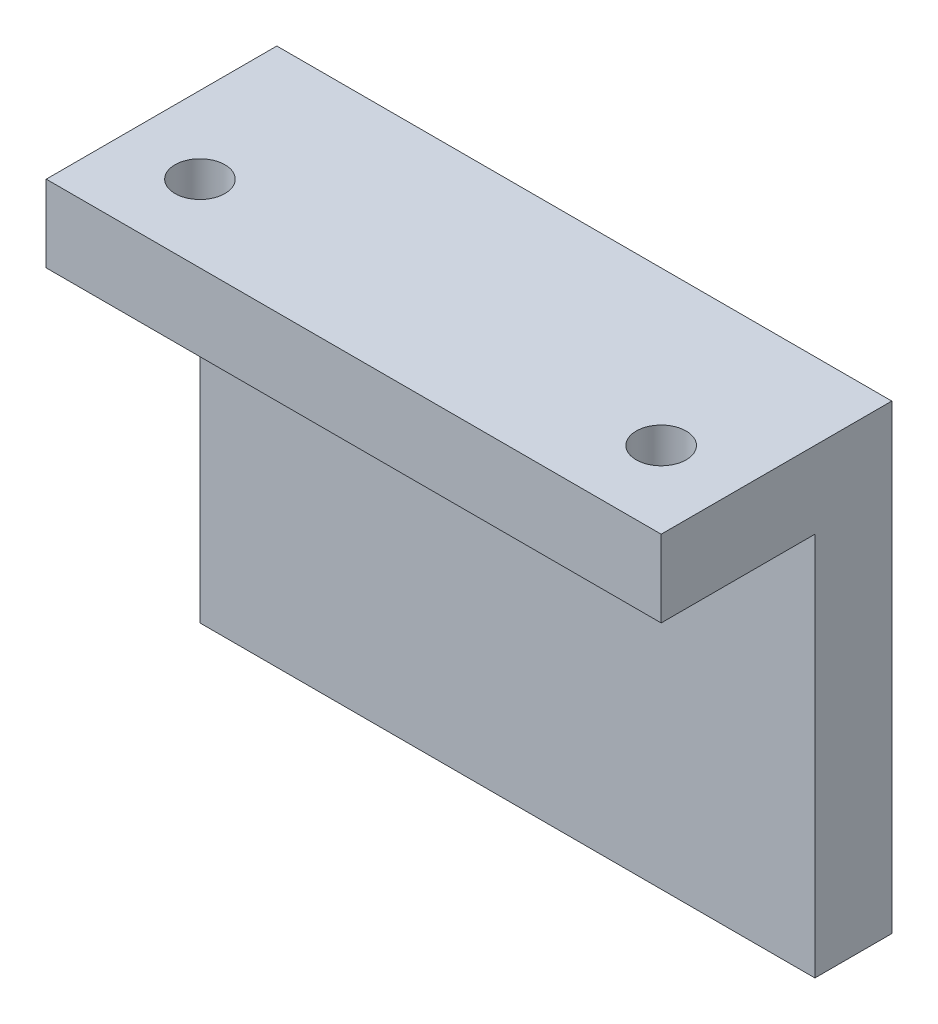
ISO-10303-21;
HEADER;
FILE_DESCRIPTION(('STEP AP214'),'2;1');
FILE_NAME('part.step','',(''),(''),'','','');
FILE_SCHEMA(('AUTOMOTIVE_DESIGN { 1 0 10303 214 1 1 1 1 }'));
ENDSEC;
DATA;
#1=APPLICATION_CONTEXT('core data for automotive mechanical design processes');
#2=APPLICATION_PROTOCOL_DEFINITION('international standard','automotive_design',2000,#1);
#3=PRODUCT_CONTEXT('',#1,'mechanical');
#4=PRODUCT('Part','Part','',(#3));
#5=PRODUCT_RELATED_PRODUCT_CATEGORY('part','',(#4));
#6=PRODUCT_DEFINITION_FORMATION('','',#4);
#7=PRODUCT_DEFINITION_CONTEXT('part definition',#1,'design');
#8=PRODUCT_DEFINITION('design','',#6,#7);
#9=PRODUCT_DEFINITION_SHAPE('','',#8);
#10=(LENGTH_UNIT() NAMED_UNIT(*) SI_UNIT(.MILLI.,.METRE.));
#11=(NAMED_UNIT(*) PLANE_ANGLE_UNIT() SI_UNIT($,.RADIAN.));
#12=(NAMED_UNIT(*) SI_UNIT($,.STERADIAN.) SOLID_ANGLE_UNIT());
#13=UNCERTAINTY_MEASURE_WITH_UNIT(LENGTH_MEASURE(1.E-05),#10,'distance_accuracy_value','');
#14=(GEOMETRIC_REPRESENTATION_CONTEXT(3) GLOBAL_UNCERTAINTY_ASSIGNED_CONTEXT((#13)) GLOBAL_UNIT_ASSIGNED_CONTEXT((#10,
#11,#12)) REPRESENTATION_CONTEXT('',''));
#15=CARTESIAN_POINT('',(0.,0.,0.));
#16=DIRECTION('',(0.,0.,1.));
#17=DIRECTION('',(1.,0.,0.));
#18=AXIS2_PLACEMENT_3D('',#15,#16,#17);
#19=CARTESIAN_POINT('',(0.,0.,5.));
#20=DIRECTION('',(1.,0.,0.));
#21=DIRECTION('',(0.,1.,0.));
#22=AXIS2_PLACEMENT_3D('',#19,#20,#21);
#23=PLANE('',#22);
#24=DIRECTION('',(0.,-1.,0.));
#25=VECTOR('',#24,1.);
#26=CARTESIAN_POINT('',(0.,0.,0.));
#27=LINE('',#26,#25);
#28=CARTESIAN_POINT('',(0.,0.,0.));
#29=VERTEX_POINT('',#28);
#30=CARTESIAN_POINT('',(0.,-30.,0.));
#31=VERTEX_POINT('',#30);
#32=EDGE_CURVE('E92',#29,#31,#27,.T.);
#33=ORIENTED_EDGE('',*,*,#32,.T.);
#34=DIRECTION('',(0.,0.,-1.));
#35=VECTOR('',#34,1.);
#36=CARTESIAN_POINT('',(0.,-30.,5.));
#37=LINE('',#36,#35);
#38=CARTESIAN_POINT('',(0.,-30.,5.));
#39=VERTEX_POINT('',#38);
#40=EDGE_CURVE('E11',#39,#31,#37,.T.);
#41=ORIENTED_EDGE('',*,*,#40,.F.);
#42=DIRECTION('',(0.,-1.,0.));
#43=VECTOR('',#42,1.);
#44=CARTESIAN_POINT('',(0.,0.,5.));
#45=LINE('',#44,#43);
#46=CARTESIAN_POINT('',(0.,-5.,5.));
#47=VERTEX_POINT('',#46);
#48=EDGE_CURVE('E85',#47,#39,#45,.T.);
#49=ORIENTED_EDGE('',*,*,#48,.F.);
#50=DIRECTION('',(0.,0.,-1.));
#51=VECTOR('',#50,1.);
#52=CARTESIAN_POINT('',(0.,-5.00000000000001,15.));
#53=LINE('',#52,#51);
#54=CARTESIAN_POINT('',(0.,-5.00000000000001,15.));
#55=VERTEX_POINT('',#54);
#56=EDGE_CURVE('E100',#55,#47,#53,.T.);
#57=ORIENTED_EDGE('',*,*,#56,.F.);
#58=DIRECTION('',(0.,-1.,0.));
#59=VECTOR('',#58,1.);
#60=CARTESIAN_POINT('',(0.,0.,15.));
#61=LINE('',#60,#59);
#62=CARTESIAN_POINT('',(0.,0.,15.));
#63=VERTEX_POINT('',#62);
#64=EDGE_CURVE('E95',#63,#55,#61,.T.);
#65=ORIENTED_EDGE('',*,*,#64,.F.);
#66=DIRECTION('',(0.,0.,-1.));
#67=VECTOR('',#66,1.);
#68=CARTESIAN_POINT('',(0.,0.,5.));
#69=LINE('',#68,#67);
#70=EDGE_CURVE('E78',#63,#29,#69,.T.);
#71=ORIENTED_EDGE('',*,*,#70,.T.);
#72=EDGE_LOOP('',(#33,#41,#49,#57,#65,#71));
#73=FACE_BOUND('',#72,.T.);
#74=ADVANCED_FACE('F33',(#73),#23,.F.);
#75=CARTESIAN_POINT('',(0.,-30.,5.));
#76=DIRECTION('',(0.,1.,0.));
#77=DIRECTION('',(0.,0.,1.));
#78=AXIS2_PLACEMENT_3D('',#75,#76,#77);
#79=PLANE('',#78);
#80=DIRECTION('',(1.,0.,0.));
#81=VECTOR('',#80,1.);
#82=CARTESIAN_POINT('',(0.,-30.,0.));
#83=LINE('',#82,#81);
#84=CARTESIAN_POINT('',(40.,-30.,0.));
#85=VERTEX_POINT('',#84);
#86=EDGE_CURVE('E99',#31,#85,#83,.T.);
#87=ORIENTED_EDGE('',*,*,#86,.T.);
#88=DIRECTION('',(0.,0.,-1.));
#89=VECTOR('',#88,1.);
#90=CARTESIAN_POINT('',(40.,-30.,5.));
#91=LINE('',#90,#89);
#92=CARTESIAN_POINT('',(40.,-30.,5.));
#93=VERTEX_POINT('',#92);
#94=EDGE_CURVE('E40',#93,#85,#91,.T.);
#95=ORIENTED_EDGE('',*,*,#94,.F.);
#96=DIRECTION('',(1.,0.,0.));
#97=VECTOR('',#96,1.);
#98=CARTESIAN_POINT('',(0.,-30.,5.));
#99=LINE('',#98,#97);
#100=EDGE_CURVE('E53',#39,#93,#99,.T.);
#101=ORIENTED_EDGE('',*,*,#100,.F.);
#102=ORIENTED_EDGE('',*,*,#40,.T.);
#103=EDGE_LOOP('',(#87,#95,#101,#102));
#104=FACE_BOUND('',#103,.T.);
#105=ADVANCED_FACE('F116',(#104),#79,.F.);
#106=CARTESIAN_POINT('',(40.,0.,5.));
#107=DIRECTION('',(-1.,0.,0.));
#108=DIRECTION('',(0.,-1.,0.));
#109=AXIS2_PLACEMENT_3D('',#106,#107,#108);
#110=PLANE('',#109);
#111=DIRECTION('',(0.,1.,0.));
#112=VECTOR('',#111,1.);
#113=CARTESIAN_POINT('',(40.,0.,0.));
#114=LINE('',#113,#112);
#115=CARTESIAN_POINT('',(40.,0.,0.));
#116=VERTEX_POINT('',#115);
#117=EDGE_CURVE('E86',#85,#116,#114,.T.);
#118=ORIENTED_EDGE('',*,*,#117,.T.);
#119=DIRECTION('',(0.,0.,-1.));
#120=VECTOR('',#119,1.);
#121=CARTESIAN_POINT('',(40.,0.,5.));
#122=LINE('',#121,#120);
#123=CARTESIAN_POINT('',(40.,0.,15.));
#124=VERTEX_POINT('',#123);
#125=EDGE_CURVE('E81',#124,#116,#122,.T.);
#126=ORIENTED_EDGE('',*,*,#125,.F.);
#127=DIRECTION('',(0.,1.,0.));
#128=VECTOR('',#127,1.);
#129=CARTESIAN_POINT('',(40.,0.,15.));
#130=LINE('',#129,#128);
#131=CARTESIAN_POINT('',(40.,-5.,15.));
#132=VERTEX_POINT('',#131);
#133=EDGE_CURVE('E136',#132,#124,#130,.T.);
#134=ORIENTED_EDGE('',*,*,#133,.F.);
#135=DIRECTION('',(0.,0.,-1.));
#136=VECTOR('',#135,1.);
#137=CARTESIAN_POINT('',(40.,-5.,15.));
#138=LINE('',#137,#136);
#139=CARTESIAN_POINT('',(40.,-5.,5.));
#140=VERTEX_POINT('',#139);
#141=EDGE_CURVE('E104',#132,#140,#138,.T.);
#142=ORIENTED_EDGE('',*,*,#141,.T.);
#143=DIRECTION('',(0.,1.,0.));
#144=VECTOR('',#143,1.);
#145=CARTESIAN_POINT('',(40.,0.,5.));
#146=LINE('',#145,#144);
#147=EDGE_CURVE('E96',#93,#140,#146,.T.);
#148=ORIENTED_EDGE('',*,*,#147,.F.);
#149=ORIENTED_EDGE('',*,*,#94,.T.);
#150=EDGE_LOOP('',(#118,#126,#134,#142,#148,#149));
#151=FACE_BOUND('',#150,.T.);
#152=ADVANCED_FACE('F113',(#151),#110,.F.);
#153=CARTESIAN_POINT('',(0.,0.,5.));
#154=DIRECTION('',(0.,-1.,0.));
#155=DIRECTION('',(0.,0.,-1.));
#156=AXIS2_PLACEMENT_3D('',#153,#154,#155);
#157=PLANE('',#156);
#158=CARTESIAN_POINT('',(5.,0.,10.));
#159=DIRECTION('',(0.,-1.,0.));
#160=DIRECTION('',(1.,0.,0.));
#161=AXIS2_PLACEMENT_3D('',#158,#159,#160);
#162=CIRCLE('',#161,1.625);
#163=CARTESIAN_POINT('',(6.625,0.,10.));
#164=VERTEX_POINT('',#163);
#165=EDGE_CURVE('E137',#164,#164,#162,.T.);
#166=ORIENTED_EDGE('',*,*,#165,.T.);
#167=EDGE_LOOP('',(#166));
#168=FACE_BOUND('',#167,.T.);
#169=CARTESIAN_POINT('',(35.,0.,10.));
#170=DIRECTION('',(0.,-1.,0.));
#171=DIRECTION('',(1.,0.,0.));
#172=AXIS2_PLACEMENT_3D('',#169,#170,#171);
#173=CIRCLE('',#172,1.625);
#174=CARTESIAN_POINT('',(36.625,0.,10.));
#175=VERTEX_POINT('',#174);
#176=EDGE_CURVE('E149',#175,#175,#173,.T.);
#177=ORIENTED_EDGE('',*,*,#176,.T.);
#178=EDGE_LOOP('',(#177));
#179=FACE_BOUND('',#178,.T.);
#180=DIRECTION('',(-1.,0.,0.));
#181=VECTOR('',#180,1.);
#182=CARTESIAN_POINT('',(0.,0.,0.));
#183=LINE('',#182,#181);
#184=EDGE_CURVE('E73',#116,#29,#183,.T.);
#185=ORIENTED_EDGE('',*,*,#184,.T.);
#186=ORIENTED_EDGE('',*,*,#70,.F.);
#187=DIRECTION('',(-1.,0.,0.));
#188=VECTOR('',#187,1.);
#189=CARTESIAN_POINT('',(40.,0.,15.));
#190=LINE('',#189,#188);
#191=EDGE_CURVE('E132',#124,#63,#190,.T.);
#192=ORIENTED_EDGE('',*,*,#191,.F.);
#193=ORIENTED_EDGE('',*,*,#125,.T.);
#194=EDGE_LOOP('',(#185,#186,#192,#193));
#195=FACE_BOUND('',#194,.T.);
#196=ADVANCED_FACE('F75',(#168,#179,#195),#157,.F.);
#197=CARTESIAN_POINT('',(0.,0.,5.));
#198=DIRECTION('',(0.,0.,1.));
#199=DIRECTION('',(1.,0.,0.));
#200=AXIS2_PLACEMENT_3D('',#197,#198,#199);
#201=PLANE('',#200);
#202=DIRECTION('',(1.,0.,0.));
#203=VECTOR('',#202,1.);
#204=CARTESIAN_POINT('',(40.,-5.,5.));
#205=LINE('',#204,#203);
#206=EDGE_CURVE('E47',#47,#140,#205,.T.);
#207=ORIENTED_EDGE('',*,*,#206,.F.);
#208=ORIENTED_EDGE('',*,*,#48,.T.);
#209=ORIENTED_EDGE('',*,*,#100,.T.);
#210=ORIENTED_EDGE('',*,*,#147,.T.);
#211=EDGE_LOOP('',(#207,#208,#209,#210));
#212=FACE_BOUND('',#211,.T.);
#213=ADVANCED_FACE('F138',(#212),#201,.T.);
#214=CARTESIAN_POINT('',(0.,0.,0.));
#215=DIRECTION('',(0.,0.,1.));
#216=DIRECTION('',(1.,0.,0.));
#217=AXIS2_PLACEMENT_3D('',#214,#215,#216);
#218=PLANE('',#217);
#219=CARTESIAN_POINT('',(9.1,-20.9,0.));
#220=DIRECTION('',(0.,0.,-1.));
#221=DIRECTION('',(-1.,0.,0.));
#222=AXIS2_PLACEMENT_3D('',#219,#220,#221);
#223=CIRCLE('',#222,2.6);
#224=CARTESIAN_POINT('',(6.5,-20.9,0.));
#225=VERTEX_POINT('',#224);
#226=EDGE_CURVE('E158',#225,#225,#223,.T.);
#227=ORIENTED_EDGE('',*,*,#226,.F.);
#228=EDGE_LOOP('',(#227));
#229=FACE_BOUND('',#228,.T.);
#230=ORIENTED_EDGE('',*,*,#32,.F.);
#231=ORIENTED_EDGE('',*,*,#184,.F.);
#232=ORIENTED_EDGE('',*,*,#117,.F.);
#233=ORIENTED_EDGE('',*,*,#86,.F.);
#234=EDGE_LOOP('',(#230,#231,#232,#233));
#235=FACE_BOUND('',#234,.T.);
#236=ADVANCED_FACE('F98',(#229,#235),#218,.F.);
#237=CARTESIAN_POINT('',(40.,-5.,15.));
#238=DIRECTION('',(0.,1.,0.));
#239=DIRECTION('',(-1.,0.,0.));
#240=AXIS2_PLACEMENT_3D('',#237,#238,#239);
#241=PLANE('',#240);
#242=CARTESIAN_POINT('',(5.,-5.,10.));
#243=DIRECTION('',(0.,-1.,0.));
#244=DIRECTION('',(1.,0.,0.));
#245=AXIS2_PLACEMENT_3D('',#242,#243,#244);
#246=CIRCLE('',#245,1.625);
#247=CARTESIAN_POINT('',(6.625,-5.,10.));
#248=VERTEX_POINT('',#247);
#249=EDGE_CURVE('E153',#248,#248,#246,.T.);
#250=ORIENTED_EDGE('',*,*,#249,.F.);
#251=EDGE_LOOP('',(#250));
#252=FACE_BOUND('',#251,.T.);
#253=CARTESIAN_POINT('',(35.,-5.,10.));
#254=DIRECTION('',(0.,-1.,0.));
#255=DIRECTION('',(1.,0.,0.));
#256=AXIS2_PLACEMENT_3D('',#253,#254,#255);
#257=CIRCLE('',#256,1.625);
#258=CARTESIAN_POINT('',(36.625,-5.,10.));
#259=VERTEX_POINT('',#258);
#260=EDGE_CURVE('E146',#259,#259,#257,.T.);
#261=ORIENTED_EDGE('',*,*,#260,.F.);
#262=EDGE_LOOP('',(#261));
#263=FACE_BOUND('',#262,.T.);
#264=ORIENTED_EDGE('',*,*,#206,.T.);
#265=ORIENTED_EDGE('',*,*,#141,.F.);
#266=DIRECTION('',(1.,0.,0.));
#267=VECTOR('',#266,1.);
#268=CARTESIAN_POINT('',(40.,-5.,15.));
#269=LINE('',#268,#267);
#270=EDGE_CURVE('E125',#55,#132,#269,.T.);
#271=ORIENTED_EDGE('',*,*,#270,.F.);
#272=ORIENTED_EDGE('',*,*,#56,.T.);
#273=EDGE_LOOP('',(#264,#265,#271,#272));
#274=FACE_BOUND('',#273,.T.);
#275=ADVANCED_FACE('F121',(#252,#263,#274),#241,.F.);
#276=CARTESIAN_POINT('',(0.,0.,15.));
#277=DIRECTION('',(0.,0.,-1.));
#278=DIRECTION('',(-1.,0.,0.));
#279=AXIS2_PLACEMENT_3D('',#276,#277,#278);
#280=PLANE('',#279);
#281=ORIENTED_EDGE('',*,*,#133,.T.);
#282=ORIENTED_EDGE('',*,*,#191,.T.);
#283=ORIENTED_EDGE('',*,*,#64,.T.);
#284=ORIENTED_EDGE('',*,*,#270,.T.);
#285=EDGE_LOOP('',(#281,#282,#283,#284));
#286=FACE_BOUND('',#285,.T.);
#287=ADVANCED_FACE('F143',(#286),#280,.F.);
#288=CARTESIAN_POINT('',(35.,0.,10.));
#289=DIRECTION('',(0.,-1.,0.));
#290=DIRECTION('',(1.,0.,0.));
#291=AXIS2_PLACEMENT_3D('',#288,#289,#290);
#292=CYLINDRICAL_SURFACE('',#291,1.625);
#293=ORIENTED_EDGE('',*,*,#176,.F.);
#294=EDGE_LOOP('',(#293));
#295=FACE_BOUND('',#294,.T.);
#296=ORIENTED_EDGE('',*,*,#260,.T.);
#297=EDGE_LOOP('',(#296));
#298=FACE_BOUND('',#297,.T.);
#299=ADVANCED_FACE('F201',(#295,#298),#292,.F.);
#300=CARTESIAN_POINT('',(5.,0.,10.));
#301=DIRECTION('',(0.,-1.,0.));
#302=DIRECTION('',(1.,0.,0.));
#303=AXIS2_PLACEMENT_3D('',#300,#301,#302);
#304=CYLINDRICAL_SURFACE('',#303,1.625);
#305=ORIENTED_EDGE('',*,*,#165,.F.);
#306=EDGE_LOOP('',(#305));
#307=FACE_BOUND('',#306,.T.);
#308=ORIENTED_EDGE('',*,*,#249,.T.);
#309=EDGE_LOOP('',(#308));
#310=FACE_BOUND('',#309,.T.);
#311=ADVANCED_FACE('F169',(#307,#310),#304,.F.);
#312=CARTESIAN_POINT('',(9.1,-20.9,4.));
#313=DIRECTION('',(0.,0.,-1.));
#314=DIRECTION('',(-1.,0.,0.));
#315=AXIS2_PLACEMENT_3D('',#312,#313,#314);
#316=CYLINDRICAL_SURFACE('',#315,2.6);
#317=CARTESIAN_POINT('',(9.1,-20.9,4.));
#318=DIRECTION('',(0.,0.,-1.));
#319=DIRECTION('',(-1.,0.,0.));
#320=AXIS2_PLACEMENT_3D('',#317,#318,#319);
#321=CIRCLE('',#320,2.6);
#322=CARTESIAN_POINT('',(6.5,-20.9,4.));
#323=VERTEX_POINT('',#322);
#324=EDGE_CURVE('E150',#323,#323,#321,.T.);
#325=ORIENTED_EDGE('',*,*,#324,.F.);
#326=EDGE_LOOP('',(#325));
#327=FACE_BOUND('',#326,.T.);
#328=ORIENTED_EDGE('',*,*,#226,.T.);
#329=EDGE_LOOP('',(#328));
#330=FACE_BOUND('',#329,.T.);
#331=ADVANCED_FACE('F166',(#327,#330),#316,.F.);
#332=CARTESIAN_POINT('',(9.1,-20.9,4.));
#333=DIRECTION('',(0.,0.,-1.));
#334=DIRECTION('',(-1.,0.,0.));
#335=AXIS2_PLACEMENT_3D('',#332,#333,#334);
#336=PLANE('',#335);
#337=ORIENTED_EDGE('',*,*,#324,.T.);
#338=EDGE_LOOP('',(#337));
#339=FACE_BOUND('',#338,.T.);
#340=ADVANCED_FACE('F164',(#339),#336,.T.);
#341=CLOSED_SHELL('',(#74,#105,#152,#196,#213,#236,#275,#287,#299,#311,#331,#340));
#342=MANIFOLD_SOLID_BREP('B2',#341);
#343=ADVANCED_BREP_SHAPE_REPRESENTATION('',(#18,#342),#14);
#344=SHAPE_DEFINITION_REPRESENTATION(#9,#343);
ENDSEC;
END-ISO-10303-21;
